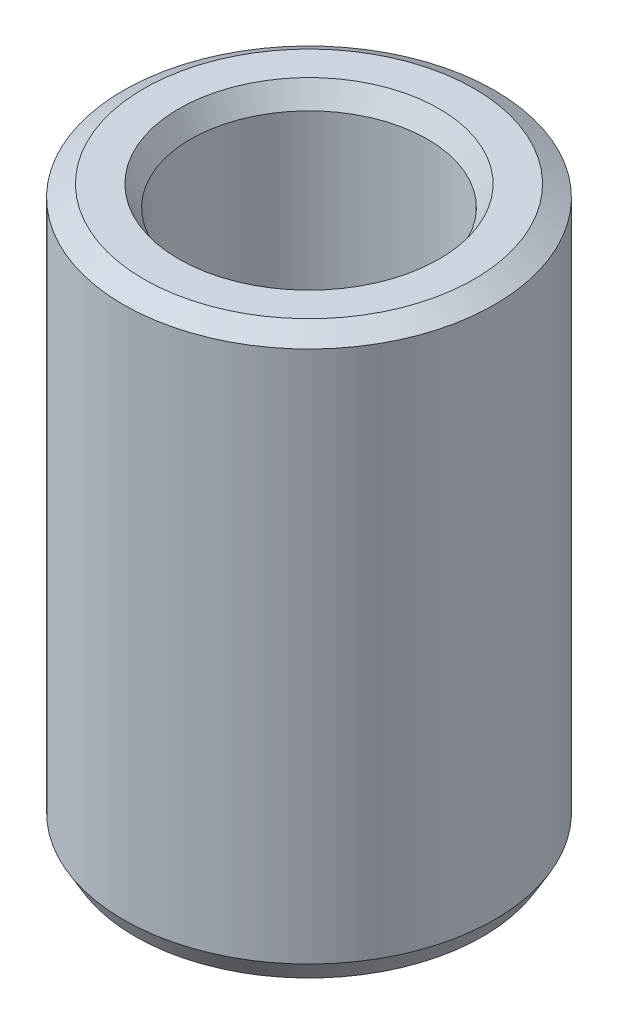
ISO-10303-21;
HEADER;
FILE_DESCRIPTION(('STEP AP214'),'2;1');
FILE_NAME('part.step','',(''),(''),'','','');
FILE_SCHEMA(('AUTOMOTIVE_DESIGN { 1 0 10303 214 1 1 1 1 }'));
ENDSEC;
DATA;
#1=APPLICATION_CONTEXT('core data for automotive mechanical design processes');
#2=APPLICATION_PROTOCOL_DEFINITION('international standard','automotive_design',2000,#1);
#3=PRODUCT_CONTEXT('',#1,'mechanical');
#4=PRODUCT('Part','Part','',(#3));
#5=PRODUCT_RELATED_PRODUCT_CATEGORY('part','',(#4));
#6=PRODUCT_DEFINITION_FORMATION('','',#4);
#7=PRODUCT_DEFINITION_CONTEXT('part definition',#1,'design');
#8=PRODUCT_DEFINITION('design','',#6,#7);
#9=PRODUCT_DEFINITION_SHAPE('','',#8);
#10=(LENGTH_UNIT() NAMED_UNIT(*) SI_UNIT(.MILLI.,.METRE.));
#11=(NAMED_UNIT(*) PLANE_ANGLE_UNIT() SI_UNIT($,.RADIAN.));
#12=(NAMED_UNIT(*) SI_UNIT($,.STERADIAN.) SOLID_ANGLE_UNIT());
#13=UNCERTAINTY_MEASURE_WITH_UNIT(LENGTH_MEASURE(1.E-05),#10,'distance_accuracy_value','');
#14=(GEOMETRIC_REPRESENTATION_CONTEXT(3) GLOBAL_UNCERTAINTY_ASSIGNED_CONTEXT((#13)) GLOBAL_UNIT_ASSIGNED_CONTEXT((#10,
#11,#12)) REPRESENTATION_CONTEXT('',''));
#15=CARTESIAN_POINT('',(0.,0.,0.));
#16=DIRECTION('',(0.,0.,1.));
#17=DIRECTION('',(1.,0.,0.));
#18=AXIS2_PLACEMENT_3D('',#15,#16,#17);
#19=CARTESIAN_POINT('',(0.,182.612738521662,0.));
#20=DIRECTION('',(0.,-1.,0.));
#21=DIRECTION('',(0.,0.,-1.));
#22=AXIS2_PLACEMENT_3D('',#19,#20,#21);
#23=CYLINDRICAL_SURFACE('',#22,60.);
#24=CARTESIAN_POINT('',(0.,6.61033277231898,0.));
#25=DIRECTION('',(0.,1.,0.));
#26=DIRECTION('',(0.,0.,1.));
#27=AXIS2_PLACEMENT_3D('',#24,#25,#26);
#28=CIRCLE('',#27,60.);
#29=CARTESIAN_POINT('',(0.,6.61033277231896,-60.));
#30=VERTEX_POINT('',#29);
#31=EDGE_CURVE('E10',#30,#30,#28,.T.);
#32=CARTESIAN_POINT('',(0.,178.796261116131,0.));
#33=DIRECTION('',(0.,1.,0.));
#34=DIRECTION('',(0.,0.,1.));
#35=AXIS2_PLACEMENT_3D('',#32,#33,#34);
#36=CIRCLE('',#35,60.);
#37=CARTESIAN_POINT('',(0.,178.796261116131,-60.));
#38=VERTEX_POINT('',#37);
#39=EDGE_CURVE('E50',#38,#38,#36,.F.);
#40=CARTESIAN_POINT('',(0.,6.61033277231896,-60.));
#41=CARTESIAN_POINT('',(0.,8.403936192567,-60.));
#42=CARTESIAN_POINT('',(0.,10.197539612815,-60.));
#43=CARTESIAN_POINT('',(0.,13.7847464533111,-60.));
#44=CARTESIAN_POINT('',(0.,15.5783498735592,-60.));
#45=CARTESIAN_POINT('',(0.,19.1655567140553,-60.));
#46=CARTESIAN_POINT('',(0.,20.9591601343033,-60.));
#47=CARTESIAN_POINT('',(0.,24.5463669747994,-60.));
#48=CARTESIAN_POINT('',(0.,26.3399703950474,-60.));
#49=CARTESIAN_POINT('',(0.,29.9271772355435,-60.));
#50=CARTESIAN_POINT('',(0.,31.7207806557916,-60.));
#51=CARTESIAN_POINT('',(0.,35.3079874962877,-60.));
#52=CARTESIAN_POINT('',(0.,37.1015909165357,-60.));
#53=CARTESIAN_POINT('',(0.,40.6887977570318,-60.));
#54=CARTESIAN_POINT('',(0.,42.4824011772799,-60.));
#55=CARTESIAN_POINT('',(0.,46.069608017776,-60.));
#56=CARTESIAN_POINT('',(0.,47.863211438024,-60.));
#57=CARTESIAN_POINT('',(0.,51.4504182785201,-60.));
#58=CARTESIAN_POINT('',(0.,53.2440216987682,-60.));
#59=CARTESIAN_POINT('',(0.,56.8312285392642,-60.));
#60=CARTESIAN_POINT('',(0.,58.6248319595123,-60.));
#61=CARTESIAN_POINT('',(0.,62.2120388000084,-60.));
#62=CARTESIAN_POINT('',(0.,64.0056422202564,-60.));
#63=CARTESIAN_POINT('',(0.,67.5928490607525,-60.));
#64=CARTESIAN_POINT('',(0.,69.3864524810005,-60.));
#65=CARTESIAN_POINT('',(0.,72.9736593214966,-60.));
#66=CARTESIAN_POINT('',(0.,74.7672627417447,-60.));
#67=CARTESIAN_POINT('',(0.,78.3544695822408,-60.));
#68=CARTESIAN_POINT('',(0.,80.1480730024888,-60.));
#69=CARTESIAN_POINT('',(0.,83.7352798429849,-60.));
#70=CARTESIAN_POINT('',(0.,85.528883263233,-60.));
#71=CARTESIAN_POINT('',(0.,89.1160901037291,-60.));
#72=CARTESIAN_POINT('',(0.,90.9096935239771,-60.));
#73=CARTESIAN_POINT('',(0.,94.4969003644732,-60.));
#74=CARTESIAN_POINT('',(0.,96.2905037847212,-60.));
#75=CARTESIAN_POINT('',(0.,99.8777106252173,-60.));
#76=CARTESIAN_POINT('',(0.,101.671314045465,-60.));
#77=CARTESIAN_POINT('',(0.,105.258520885961,-60.));
#78=CARTESIAN_POINT('',(0.,107.05212430621,-60.));
#79=CARTESIAN_POINT('',(0.,110.639331146706,-60.));
#80=CARTESIAN_POINT('',(0.,112.432934566954,-60.));
#81=CARTESIAN_POINT('',(0.,116.02014140745,-60.));
#82=CARTESIAN_POINT('',(0.,117.813744827698,-60.));
#83=CARTESIAN_POINT('',(0.,121.400951668194,-60.));
#84=CARTESIAN_POINT('',(0.,123.194555088442,-60.));
#85=CARTESIAN_POINT('',(0.,126.781761928938,-60.));
#86=CARTESIAN_POINT('',(0.,128.575365349186,-60.));
#87=CARTESIAN_POINT('',(0.,132.162572189682,-60.));
#88=CARTESIAN_POINT('',(0.,133.95617560993,-60.));
#89=CARTESIAN_POINT('',(0.,137.543382450426,-60.));
#90=CARTESIAN_POINT('',(0.,139.336985870674,-60.));
#91=CARTESIAN_POINT('',(0.,142.92419271117,-60.));
#92=CARTESIAN_POINT('',(0.,144.717796131418,-60.));
#93=CARTESIAN_POINT('',(0.,148.305002971915,-60.));
#94=CARTESIAN_POINT('',(0.,150.098606392163,-60.));
#95=CARTESIAN_POINT('',(0.,153.685813232659,-60.));
#96=CARTESIAN_POINT('',(0.,155.479416652907,-60.));
#97=CARTESIAN_POINT('',(0.,159.066623493403,-60.));
#98=CARTESIAN_POINT('',(0.,160.860226913651,-60.));
#99=CARTESIAN_POINT('',(0.,164.447433754147,-60.));
#100=CARTESIAN_POINT('',(0.,166.241037174395,-60.));
#101=CARTESIAN_POINT('',(0.,169.828244014891,-60.));
#102=CARTESIAN_POINT('',(0.,171.621847435139,-60.));
#103=CARTESIAN_POINT('',(0.,175.209054275635,-60.));
#104=CARTESIAN_POINT('',(0.,177.002657695883,-60.));
#105=CARTESIAN_POINT('',(0.,178.796261116131,-60.));
#106=B_SPLINE_CURVE_WITH_KNOTS('',3,(#40,#41,#42,#43,#44,#45,#46,#47,#48,#49,#50,#51,#52,#53,
#54,#55,#56,#57,#58,#59,#60,#61,#62,#63,#64,#65,#66,#67,#68,#69,#70,#71,#72,#73,#74,#75,#76,#77,
#78,#79,#80,#81,#82,#83,#84,#85,#86,#87,#88,#89,#90,#91,#92,#93,#94,#95,#96,#97,#98,#99,#100,
#101,#102,#103,#104,#105),.UNSPECIFIED.,.F.,.F.,(4,2,2,2,2,2,2,2,2,2,2,2,2,2,2,2,2,2,2,2,2,2,2,
2,2,2,2,2,2,2,2,2,4),(0.,5.38081026074413,10.7616205214883,16.1424307822324,21.5232410429765,
26.9040513037207,32.2848615644648,37.665671825209,43.0464820859531,48.4272923466972,
53.8081026074414,59.1889128681855,64.5697231289296,69.9505333896738,75.3313436504179,
80.712153911162,86.0929641719062,91.4737744326503,96.8545846933944,102.235394954139,
107.616205214883,112.997015475627,118.377825736371,123.758635997115,129.139446257859,
134.520256518603,139.901066779348,145.281877040092,150.662687300836,156.04349756158,
161.424307822324,166.805118083068,172.185928343812),.UNSPECIFIED.);
#107=EDGE_CURVE('BSEAM39',#30,#38,#106,.T.);
#108=ORIENTED_EDGE('',*,*,#31,.T.);
#109=ORIENTED_EDGE('',*,*,#39,.T.);
#110=ORIENTED_EDGE('',*,*,#107,.T.);
#111=ORIENTED_EDGE('',*,*,#107,.F.);
#112=EDGE_LOOP('',(#108,#110,#109,#111));
#113=FACE_BOUND('',#112,.T.);
#114=ADVANCED_FACE('F39',(#113),#23,.T.);
#115=CARTESIAN_POINT('',(0.,182.612738521662,0.));
#116=DIRECTION('',(0.,1.,0.));
#117=DIRECTION('',(0.,0.,1.));
#118=AXIS2_PLACEMENT_3D('',#115,#116,#117);
#119=PLANE('',#118);
#120=CARTESIAN_POINT('',(0.,182.612738521662,0.));
#121=DIRECTION('',(0.,1.,0.));
#122=DIRECTION('',(0.,0.,1.));
#123=AXIS2_PLACEMENT_3D('',#120,#121,#122);
#124=CIRCLE('',#123,42.0943412675067);
#125=CARTESIAN_POINT('',(0.,182.612738521662,42.0943412675067));
#126=VERTEX_POINT('',#125);
#127=EDGE_CURVE('E58',#126,#126,#124,.F.);
#128=ORIENTED_EDGE('',*,*,#127,.T.);
#129=EDGE_LOOP('',(#128));
#130=FACE_BOUND('',#129,.T.);
#131=CARTESIAN_POINT('',(0.,182.612738521662,0.));
#132=DIRECTION('',(0.,1.,0.));
#133=DIRECTION('',(0.,0.,1.));
#134=AXIS2_PLACEMENT_3D('',#131,#132,#133);
#135=CIRCLE('',#134,53.3896672276814);
#136=CARTESIAN_POINT('',(0.,182.612738521662,53.3896672276814));
#137=VERTEX_POINT('',#136);
#138=EDGE_CURVE('E61',#137,#137,#135,.T.);
#139=ORIENTED_EDGE('',*,*,#138,.T.);
#140=EDGE_LOOP('',(#139));
#141=FACE_BOUND('',#140,.T.);
#142=ADVANCED_FACE('F88',(#130,#141),#119,.T.);
#143=CARTESIAN_POINT('',(0.,0.,0.));
#144=DIRECTION('',(0.,1.,0.));
#145=DIRECTION('',(0.,0.,1.));
#146=AXIS2_PLACEMENT_3D('',#143,#144,#145);
#147=PLANE('',#146);
#148=CARTESIAN_POINT('',(0.,0.,0.));
#149=DIRECTION('',(0.,1.,0.));
#150=DIRECTION('',(0.,0.,1.));
#151=AXIS2_PLACEMENT_3D('',#148,#149,#150);
#152=CIRCLE('',#151,44.8881966342939);
#153=CARTESIAN_POINT('',(0.,0.,44.8881966342939));
#154=VERTEX_POINT('',#153);
#155=EDGE_CURVE('E51',#154,#154,#152,.T.);
#156=ORIENTED_EDGE('',*,*,#155,.T.);
#157=EDGE_LOOP('',(#156));
#158=FACE_BOUND('',#157,.T.);
#159=CARTESIAN_POINT('',(0.,0.,0.));
#160=DIRECTION('',(0.,1.,0.));
#161=DIRECTION('',(0.,0.,1.));
#162=AXIS2_PLACEMENT_3D('',#159,#160,#161);
#163=CIRCLE('',#162,56.1835225944686);
#164=CARTESIAN_POINT('',(0.,0.,56.1835225944686));
#165=VERTEX_POINT('',#164);
#166=EDGE_CURVE('E54',#165,#165,#163,.F.);
#167=ORIENTED_EDGE('',*,*,#166,.T.);
#168=EDGE_LOOP('',(#167));
#169=FACE_BOUND('',#168,.T.);
#170=ADVANCED_FACE('F83',(#158,#169),#147,.F.);
#171=CARTESIAN_POINT('',(0.,182.612738521662,0.));
#172=DIRECTION('',(0.,-1.,0.));
#173=DIRECTION('',(0.,0.,-1.));
#174=AXIS2_PLACEMENT_3D('',#171,#172,#173);
#175=CYLINDRICAL_SURFACE('',#174,38.2778638619754);
#176=CARTESIAN_POINT('',(0.,176.002405749343,0.));
#177=DIRECTION('',(0.,1.,0.));
#178=DIRECTION('',(0.,0.,1.));
#179=AXIS2_PLACEMENT_3D('',#176,#177,#178);
#180=CIRCLE('',#179,38.2778638619754);
#181=CARTESIAN_POINT('',(0.,176.002405749343,-38.2778638619754));
#182=VERTEX_POINT('',#181);
#183=EDGE_CURVE('E67',#182,#182,#180,.T.);
#184=CARTESIAN_POINT('',(0.,3.81647740553115,0.));
#185=DIRECTION('',(0.,1.,0.));
#186=DIRECTION('',(0.,0.,1.));
#187=AXIS2_PLACEMENT_3D('',#184,#185,#186);
#188=CIRCLE('',#187,38.2778638619754);
#189=CARTESIAN_POINT('',(0.,3.81647740553112,-38.2778638619754));
#190=VERTEX_POINT('',#189);
#191=EDGE_CURVE('E69',#190,#190,#188,.F.);
#192=CARTESIAN_POINT('',(0.,176.002405749343,-38.2778638619754));
#193=CARTESIAN_POINT('',(0.,174.208802329095,-38.2778638619754));
#194=CARTESIAN_POINT('',(0.,172.415198908847,-38.2778638619754));
#195=CARTESIAN_POINT('',(0.,168.827992068351,-38.2778638619754));
#196=CARTESIAN_POINT('',(0.,167.034388648103,-38.2778638619754));
#197=CARTESIAN_POINT('',(0.,163.447181807607,-38.2778638619754));
#198=CARTESIAN_POINT('',(0.,161.653578387359,-38.2778638619754));
#199=CARTESIAN_POINT('',(0.,158.066371546863,-38.2778638619754));
#200=CARTESIAN_POINT('',(0.,156.272768126615,-38.2778638619754));
#201=CARTESIAN_POINT('',(0.,152.685561286119,-38.2778638619754));
#202=CARTESIAN_POINT('',(0.,150.891957865871,-38.2778638619754));
#203=CARTESIAN_POINT('',(0.,147.304751025375,-38.2778638619754));
#204=CARTESIAN_POINT('',(0.,145.511147605127,-38.2778638619754));
#205=CARTESIAN_POINT('',(0.,141.923940764631,-38.2778638619754));
#206=CARTESIAN_POINT('',(0.,140.130337344383,-38.2778638619754));
#207=CARTESIAN_POINT('',(0.,136.543130503886,-38.2778638619754));
#208=CARTESIAN_POINT('',(0.,134.749527083638,-38.2778638619754));
#209=CARTESIAN_POINT('',(0.,131.162320243142,-38.2778638619754));
#210=CARTESIAN_POINT('',(0.,129.368716822894,-38.2778638619754));
#211=CARTESIAN_POINT('',(0.,125.781509982398,-38.2778638619754));
#212=CARTESIAN_POINT('',(0.,123.98790656215,-38.2778638619754));
#213=CARTESIAN_POINT('',(0.,120.400699721654,-38.2778638619754));
#214=CARTESIAN_POINT('',(0.,118.607096301406,-38.2778638619754));
#215=CARTESIAN_POINT('',(0.,115.01988946091,-38.2778638619754));
#216=CARTESIAN_POINT('',(0.,113.226286040662,-38.2778638619754));
#217=CARTESIAN_POINT('',(0.,109.639079200166,-38.2778638619754));
#218=CARTESIAN_POINT('',(0.,107.845475779918,-38.2778638619754));
#219=CARTESIAN_POINT('',(0.,104.258268939422,-38.2778638619754));
#220=CARTESIAN_POINT('',(0.,102.464665519174,-38.2778638619754));
#221=CARTESIAN_POINT('',(0.,98.8774586786775,-38.2778638619754));
#222=CARTESIAN_POINT('',(0.,97.0838552584295,-38.2778638619754));
#223=CARTESIAN_POINT('',(0.,93.4966484179334,-38.2778638619754));
#224=CARTESIAN_POINT('',(0.,91.7030449976854,-38.2778638619754));
#225=CARTESIAN_POINT('',(0.,88.1158381571892,-38.2778638619754));
#226=CARTESIAN_POINT('',(0.,86.3222347369412,-38.2778638619754));
#227=CARTESIAN_POINT('',(0.,82.7350278964451,-38.2778638619754));
#228=CARTESIAN_POINT('',(0.,80.9414244761971,-38.2778638619754));
#229=CARTESIAN_POINT('',(0.,77.354217635701,-38.2778638619754));
#230=CARTESIAN_POINT('',(0.,75.5606142154529,-38.2778638619754));
#231=CARTESIAN_POINT('',(0.,71.9734073749568,-38.2778638619754));
#232=CARTESIAN_POINT('',(0.,70.1798039547088,-38.2778638619754));
#233=CARTESIAN_POINT('',(0.,66.5925971142127,-38.2778638619754));
#234=CARTESIAN_POINT('',(0.,64.7989936939647,-38.2778638619754));
#235=CARTESIAN_POINT('',(0.,61.2117868534686,-38.2778638619754));
#236=CARTESIAN_POINT('',(0.,59.4181834332205,-38.2778638619754));
#237=CARTESIAN_POINT('',(0.,55.8309765927244,-38.2778638619754));
#238=CARTESIAN_POINT('',(0.,54.0373731724764,-38.2778638619754));
#239=CARTESIAN_POINT('',(0.,50.4501663319803,-38.2778638619754));
#240=CARTESIAN_POINT('',(0.,48.6565629117323,-38.2778638619754));
#241=CARTESIAN_POINT('',(0.,45.0693560712362,-38.2778638619754));
#242=CARTESIAN_POINT('',(0.,43.2757526509881,-38.2778638619754));
#243=CARTESIAN_POINT('',(0.,39.688545810492,-38.2778638619754));
#244=CARTESIAN_POINT('',(0.,37.894942390244,-38.2778638619754));
#245=CARTESIAN_POINT('',(0.,34.3077355497479,-38.2778638619754));
#246=CARTESIAN_POINT('',(0.,32.5141321294999,-38.2778638619754));
#247=CARTESIAN_POINT('',(0.,28.9269252890038,-38.2778638619754));
#248=CARTESIAN_POINT('',(0.,27.1333218687557,-38.2778638619754));
#249=CARTESIAN_POINT('',(0.,23.5461150282596,-38.2778638619754));
#250=CARTESIAN_POINT('',(0.,21.7525116080116,-38.2778638619754));
#251=CARTESIAN_POINT('',(0.,18.1653047675155,-38.2778638619754));
#252=CARTESIAN_POINT('',(0.,16.3717013472674,-38.2778638619754));
#253=CARTESIAN_POINT('',(0.,12.7844945067714,-38.2778638619754));
#254=CARTESIAN_POINT('',(0.,10.9908910865233,-38.2778638619754));
#255=CARTESIAN_POINT('',(0.,7.40368424602723,-38.2778638619754));
#256=CARTESIAN_POINT('',(0.,5.61008082577917,-38.2778638619754));
#257=CARTESIAN_POINT('',(0.,3.81647740553112,-38.2778638619754));
#258=B_SPLINE_CURVE_WITH_KNOTS('',3,(#192,#193,#194,#195,#196,#197,#198,#199,#200,#201,#202,
#203,#204,#205,#206,#207,#208,#209,#210,#211,#212,#213,#214,#215,#216,#217,#218,#219,#220,#221,
#222,#223,#224,#225,#226,#227,#228,#229,#230,#231,#232,#233,#234,#235,#236,#237,#238,#239,#240,
#241,#242,#243,#244,#245,#246,#247,#248,#249,#250,#251,#252,#253,#254,#255,#256,#257),
.UNSPECIFIED.,.F.,.F.,(4,2,2,2,2,2,2,2,2,2,2,2,2,2,2,2,2,2,2,2,2,2,2,2,2,2,2,2,2,2,2,2,4),(0.,
5.38081026074413,10.7616205214883,16.1424307822324,21.5232410429766,26.9040513037207,
32.2848615644648,37.665671825209,43.0464820859531,48.4272923466972,53.8081026074414,
59.1889128681855,64.5697231289296,69.9505333896738,75.3313436504179,80.712153911162,
86.0929641719062,91.4737744326503,96.8545846933944,102.235394954139,107.616205214883,
112.997015475627,118.377825736371,123.758635997115,129.139446257859,134.520256518603,
139.901066779348,145.281877040092,150.662687300836,156.04349756158,161.424307822324,
166.805118083068,172.185928343812),.UNSPECIFIED.);
#259=EDGE_CURVE('BSEAM71',#182,#190,#258,.T.);
#260=ORIENTED_EDGE('',*,*,#183,.T.);
#261=ORIENTED_EDGE('',*,*,#191,.T.);
#262=ORIENTED_EDGE('',*,*,#259,.T.);
#263=ORIENTED_EDGE('',*,*,#259,.F.);
#264=EDGE_LOOP('',(#260,#262,#261,#263));
#265=FACE_BOUND('',#264,.T.);
#266=ADVANCED_FACE('F71',(#265),#175,.F.);
#267=CARTESIAN_POINT('',(0.,176.002405749343,0.));
#268=DIRECTION('',(0.,1.,0.));
#269=DIRECTION('',(0.,0.,1.));
#270=AXIS2_PLACEMENT_3D('',#267,#268,#269);
#271=CONICAL_SURFACE('',#270,38.2778638619754,0.523598775598296);
#272=ORIENTED_EDGE('',*,*,#127,.F.);
#273=EDGE_LOOP('',(#272));
#274=FACE_BOUND('',#273,.T.);
#275=ORIENTED_EDGE('',*,*,#183,.F.);
#276=EDGE_LOOP('',(#275));
#277=FACE_BOUND('',#276,.T.);
#278=ADVANCED_FACE('F77',(#274,#277),#271,.F.);
#279=CARTESIAN_POINT('',(0.,0.,0.));
#280=DIRECTION('',(0.,-1.,0.));
#281=DIRECTION('',(0.,0.,-1.));
#282=AXIS2_PLACEMENT_3D('',#279,#280,#281);
#283=CONICAL_SURFACE('',#282,44.8881966342939,1.04719755119659);
#284=ORIENTED_EDGE('',*,*,#191,.F.);
#285=EDGE_LOOP('',(#284));
#286=FACE_BOUND('',#285,.T.);
#287=ORIENTED_EDGE('',*,*,#155,.F.);
#288=EDGE_LOOP('',(#287));
#289=FACE_BOUND('',#288,.T.);
#290=ADVANCED_FACE('F73',(#286,#289),#283,.F.);
#291=CARTESIAN_POINT('',(0.,6.61033277231898,0.));
#292=DIRECTION('',(0.,1.,0.));
#293=DIRECTION('',(0.,0.,1.));
#294=AXIS2_PLACEMENT_3D('',#291,#292,#293);
#295=CONICAL_SURFACE('',#294,60.,0.523598775598302);
#296=ORIENTED_EDGE('',*,*,#166,.F.);
#297=EDGE_LOOP('',(#296));
#298=FACE_BOUND('',#297,.T.);
#299=ORIENTED_EDGE('',*,*,#31,.F.);
#300=EDGE_LOOP('',(#299));
#301=FACE_BOUND('',#300,.T.);
#302=ADVANCED_FACE('F76',(#298,#301),#295,.T.);
#303=CARTESIAN_POINT('',(0.,182.612738521662,0.));
#304=DIRECTION('',(0.,-1.,0.));
#305=DIRECTION('',(0.,0.,-1.));
#306=AXIS2_PLACEMENT_3D('',#303,#304,#305);
#307=CONICAL_SURFACE('',#306,53.3896672276814,1.0471975511966);
#308=ORIENTED_EDGE('',*,*,#39,.F.);
#309=EDGE_LOOP('',(#308));
#310=FACE_BOUND('',#309,.T.);
#311=ORIENTED_EDGE('',*,*,#138,.F.);
#312=EDGE_LOOP('',(#311));
#313=FACE_BOUND('',#312,.T.);
#314=ADVANCED_FACE('F45',(#310,#313),#307,.T.);
#315=CLOSED_SHELL('',(#114,#142,#170,#266,#278,#290,#302,#314));
#316=MANIFOLD_SOLID_BREP('B2',#315);
#317=ADVANCED_BREP_SHAPE_REPRESENTATION('',(#18,#316),#14);
#318=SHAPE_DEFINITION_REPRESENTATION(#9,#317);
ENDSEC;
END-ISO-10303-21;
